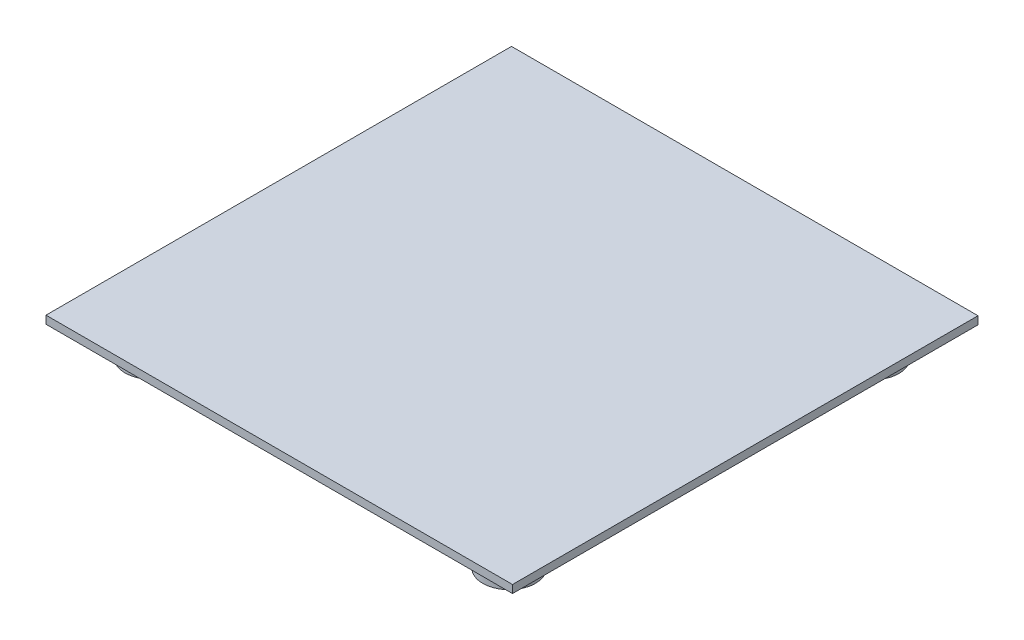
ISO-10303-21;
HEADER;
FILE_DESCRIPTION(('STEP AP214'),'2;1');
FILE_NAME('part.step','',(''),(''),'','','');
FILE_SCHEMA(('AUTOMOTIVE_DESIGN { 1 0 10303 214 1 1 1 1 }'));
ENDSEC;
DATA;
#1=APPLICATION_CONTEXT('core data for automotive mechanical design processes');
#2=APPLICATION_PROTOCOL_DEFINITION('international standard','automotive_design',2000,#1);
#3=PRODUCT_CONTEXT('',#1,'mechanical');
#4=PRODUCT('Part','Part','',(#3));
#5=PRODUCT_RELATED_PRODUCT_CATEGORY('part','',(#4));
#6=PRODUCT_DEFINITION_FORMATION('','',#4);
#7=PRODUCT_DEFINITION_CONTEXT('part definition',#1,'design');
#8=PRODUCT_DEFINITION('design','',#6,#7);
#9=PRODUCT_DEFINITION_SHAPE('','',#8);
#10=(LENGTH_UNIT() NAMED_UNIT(*) SI_UNIT(.MILLI.,.METRE.));
#11=(NAMED_UNIT(*) PLANE_ANGLE_UNIT() SI_UNIT($,.RADIAN.));
#12=(NAMED_UNIT(*) SI_UNIT($,.STERADIAN.) SOLID_ANGLE_UNIT());
#13=UNCERTAINTY_MEASURE_WITH_UNIT(LENGTH_MEASURE(1.E-05),#10,'distance_accuracy_value','');
#14=(GEOMETRIC_REPRESENTATION_CONTEXT(3) GLOBAL_UNCERTAINTY_ASSIGNED_CONTEXT((#13)) GLOBAL_UNIT_ASSIGNED_CONTEXT((#10,
#11,#12)) REPRESENTATION_CONTEXT('',''));
#15=CARTESIAN_POINT('',(0.,0.,0.));
#16=DIRECTION('',(0.,0.,1.));
#17=DIRECTION('',(1.,0.,0.));
#18=AXIS2_PLACEMENT_3D('',#15,#16,#17);
#19=CARTESIAN_POINT('',(0.,3.,0.));
#20=DIRECTION('',(1.,0.,0.));
#21=DIRECTION('',(0.,0.,-1.));
#22=AXIS2_PLACEMENT_3D('',#19,#20,#21);
#23=PLANE('',#22);
#24=DIRECTION('',(0.,0.,1.));
#25=VECTOR('',#24,1.);
#26=CARTESIAN_POINT('',(0.,0.,0.));
#27=LINE('',#26,#25);
#28=CARTESIAN_POINT('',(0.,0.,0.));
#29=VERTEX_POINT('',#28);
#30=CARTESIAN_POINT('',(0.,0.,176.52));
#31=VERTEX_POINT('',#30);
#32=EDGE_CURVE('E104',#29,#31,#27,.T.);
#33=ORIENTED_EDGE('',*,*,#32,.T.);
#34=DIRECTION('',(0.,-1.,0.));
#35=VECTOR('',#34,1.);
#36=CARTESIAN_POINT('',(0.,3.,176.52));
#37=LINE('',#36,#35);
#38=CARTESIAN_POINT('',(0.,3.,176.52));
#39=VERTEX_POINT('',#38);
#40=EDGE_CURVE('E95',#39,#31,#37,.T.);
#41=ORIENTED_EDGE('',*,*,#40,.F.);
#42=DIRECTION('',(0.,0.,1.));
#43=VECTOR('',#42,1.);
#44=CARTESIAN_POINT('',(0.,3.,0.));
#45=LINE('',#44,#43);
#46=CARTESIAN_POINT('',(0.,3.,0.));
#47=VERTEX_POINT('',#46);
#48=EDGE_CURVE('E89',#47,#39,#45,.T.);
#49=ORIENTED_EDGE('',*,*,#48,.F.);
#50=DIRECTION('',(0.,-1.,0.));
#51=VECTOR('',#50,1.);
#52=CARTESIAN_POINT('',(0.,3.,0.));
#53=LINE('',#52,#51);
#54=EDGE_CURVE('E100',#47,#29,#53,.T.);
#55=ORIENTED_EDGE('',*,*,#54,.T.);
#56=EDGE_LOOP('',(#33,#41,#49,#55));
#57=FACE_BOUND('',#56,.T.);
#58=ADVANCED_FACE('F37',(#57),#23,.F.);
#59=CARTESIAN_POINT('',(0.,3.,176.52));
#60=DIRECTION('',(0.,0.,-1.));
#61=DIRECTION('',(-1.,0.,0.));
#62=AXIS2_PLACEMENT_3D('',#59,#60,#61);
#63=PLANE('',#62);
#64=DIRECTION('',(1.,0.,0.));
#65=VECTOR('',#64,1.);
#66=CARTESIAN_POINT('',(0.,0.,176.52));
#67=LINE('',#66,#65);
#68=CARTESIAN_POINT('',(176.9,0.,176.52));
#69=VERTEX_POINT('',#68);
#70=EDGE_CURVE('E94',#31,#69,#67,.T.);
#71=ORIENTED_EDGE('',*,*,#70,.T.);
#72=DIRECTION('',(0.,-1.,0.));
#73=VECTOR('',#72,1.);
#74=CARTESIAN_POINT('',(176.9,3.,176.52));
#75=LINE('',#74,#73);
#76=CARTESIAN_POINT('',(176.9,3.,176.52));
#77=VERTEX_POINT('',#76);
#78=EDGE_CURVE('E92',#77,#69,#75,.T.);
#79=ORIENTED_EDGE('',*,*,#78,.F.);
#80=DIRECTION('',(1.,0.,0.));
#81=VECTOR('',#80,1.);
#82=CARTESIAN_POINT('',(0.,3.,176.52));
#83=LINE('',#82,#81);
#84=EDGE_CURVE('E84',#39,#77,#83,.T.);
#85=ORIENTED_EDGE('',*,*,#84,.F.);
#86=ORIENTED_EDGE('',*,*,#40,.T.);
#87=EDGE_LOOP('',(#71,#79,#85,#86));
#88=FACE_BOUND('',#87,.T.);
#89=ADVANCED_FACE('F93',(#88),#63,.F.);
#90=CARTESIAN_POINT('',(176.9,3.,0.));
#91=DIRECTION('',(-1.,0.,0.));
#92=DIRECTION('',(0.,0.,1.));
#93=AXIS2_PLACEMENT_3D('',#90,#91,#92);
#94=PLANE('',#93);
#95=DIRECTION('',(0.,0.,-1.));
#96=VECTOR('',#95,1.);
#97=CARTESIAN_POINT('',(176.9,0.,0.));
#98=LINE('',#97,#96);
#99=CARTESIAN_POINT('',(176.9,0.,0.));
#100=VERTEX_POINT('',#99);
#101=EDGE_CURVE('E70',#69,#100,#98,.T.);
#102=ORIENTED_EDGE('',*,*,#101,.T.);
#103=DIRECTION('',(0.,-1.,0.));
#104=VECTOR('',#103,1.);
#105=CARTESIAN_POINT('',(176.9,3.,0.));
#106=LINE('',#105,#104);
#107=CARTESIAN_POINT('',(176.9,3.,0.));
#108=VERTEX_POINT('',#107);
#109=EDGE_CURVE('E96',#108,#100,#106,.T.);
#110=ORIENTED_EDGE('',*,*,#109,.F.);
#111=DIRECTION('',(0.,0.,-1.));
#112=VECTOR('',#111,1.);
#113=CARTESIAN_POINT('',(176.9,3.,0.));
#114=LINE('',#113,#112);
#115=EDGE_CURVE('E87',#77,#108,#114,.T.);
#116=ORIENTED_EDGE('',*,*,#115,.F.);
#117=ORIENTED_EDGE('',*,*,#78,.T.);
#118=EDGE_LOOP('',(#102,#110,#116,#117));
#119=FACE_BOUND('',#118,.T.);
#120=ADVANCED_FACE('F98',(#119),#94,.F.);
#121=CARTESIAN_POINT('',(0.,3.,0.));
#122=DIRECTION('',(0.,0.,1.));
#123=DIRECTION('',(1.,0.,0.));
#124=AXIS2_PLACEMENT_3D('',#121,#122,#123);
#125=PLANE('',#124);
#126=DIRECTION('',(-1.,0.,0.));
#127=VECTOR('',#126,1.);
#128=CARTESIAN_POINT('',(0.,0.,0.));
#129=LINE('',#128,#127);
#130=EDGE_CURVE('E76',#100,#29,#129,.T.);
#131=ORIENTED_EDGE('',*,*,#130,.T.);
#132=ORIENTED_EDGE('',*,*,#54,.F.);
#133=DIRECTION('',(-1.,0.,0.));
#134=VECTOR('',#133,1.);
#135=CARTESIAN_POINT('',(0.,3.,0.));
#136=LINE('',#135,#134);
#137=EDGE_CURVE('E53',#108,#47,#136,.T.);
#138=ORIENTED_EDGE('',*,*,#137,.F.);
#139=ORIENTED_EDGE('',*,*,#109,.T.);
#140=EDGE_LOOP('',(#131,#132,#138,#139));
#141=FACE_BOUND('',#140,.T.);
#142=ADVANCED_FACE('F136',(#141),#125,.F.);
#143=CARTESIAN_POINT('',(0.,3.,0.));
#144=DIRECTION('',(0.,1.,0.));
#145=DIRECTION('',(0.,0.,1.));
#146=AXIS2_PLACEMENT_3D('',#143,#144,#145);
#147=PLANE('',#146);
#148=ORIENTED_EDGE('',*,*,#48,.T.);
#149=ORIENTED_EDGE('',*,*,#84,.T.);
#150=ORIENTED_EDGE('',*,*,#115,.T.);
#151=ORIENTED_EDGE('',*,*,#137,.T.);
#152=EDGE_LOOP('',(#148,#149,#150,#151));
#153=FACE_BOUND('',#152,.T.);
#154=ADVANCED_FACE('F85',(#153),#147,.T.);
#155=CARTESIAN_POINT('',(0.,0.,0.));
#156=DIRECTION('',(0.,1.,0.));
#157=DIRECTION('',(0.,0.,1.));
#158=AXIS2_PLACEMENT_3D('',#155,#156,#157);
#159=PLANE('',#158);
#160=CARTESIAN_POINT('',(156.9,0.,157.806439707891));
#161=DIRECTION('',(0.,1.,0.));
#162=DIRECTION('',(0.,0.,1.));
#163=AXIS2_PLACEMENT_3D('',#160,#161,#162);
#164=CIRCLE('',#163,10.);
#165=CARTESIAN_POINT('',(156.9,0.,167.806439707891));
#166=VERTEX_POINT('',#165);
#167=EDGE_CURVE('E11',#166,#166,#164,.F.);
#168=ORIENTED_EDGE('',*,*,#167,.F.);
#169=EDGE_LOOP('',(#168));
#170=FACE_BOUND('',#169,.T.);
#171=CARTESIAN_POINT('',(20.,0.,20.));
#172=DIRECTION('',(0.,1.,0.));
#173=DIRECTION('',(0.,0.,1.));
#174=AXIS2_PLACEMENT_3D('',#171,#172,#173);
#175=CIRCLE('',#174,10.);
#176=CARTESIAN_POINT('',(20.,0.,30.));
#177=VERTEX_POINT('',#176);
#178=EDGE_CURVE('E45',#177,#177,#175,.F.);
#179=ORIENTED_EDGE('',*,*,#178,.F.);
#180=EDGE_LOOP('',(#179));
#181=FACE_BOUND('',#180,.T.);
#182=CARTESIAN_POINT('',(156.9,0.,20.));
#183=DIRECTION('',(0.,1.,0.));
#184=DIRECTION('',(0.,0.,1.));
#185=AXIS2_PLACEMENT_3D('',#182,#183,#184);
#186=CIRCLE('',#185,10.);
#187=CARTESIAN_POINT('',(156.9,0.,30.));
#188=VERTEX_POINT('',#187);
#189=EDGE_CURVE('E117',#188,#188,#186,.F.);
#190=ORIENTED_EDGE('',*,*,#189,.F.);
#191=EDGE_LOOP('',(#190));
#192=FACE_BOUND('',#191,.T.);
#193=CARTESIAN_POINT('',(20.,0.,156.52));
#194=DIRECTION('',(0.,1.,0.));
#195=DIRECTION('',(0.,0.,1.));
#196=AXIS2_PLACEMENT_3D('',#193,#194,#195);
#197=CIRCLE('',#196,10.);
#198=CARTESIAN_POINT('',(20.,0.,166.52));
#199=VERTEX_POINT('',#198);
#200=EDGE_CURVE('E114',#199,#199,#197,.F.);
#201=ORIENTED_EDGE('',*,*,#200,.F.);
#202=EDGE_LOOP('',(#201));
#203=FACE_BOUND('',#202,.T.);
#204=ORIENTED_EDGE('',*,*,#32,.F.);
#205=ORIENTED_EDGE('',*,*,#130,.F.);
#206=ORIENTED_EDGE('',*,*,#101,.F.);
#207=ORIENTED_EDGE('',*,*,#70,.F.);
#208=EDGE_LOOP('',(#204,#205,#206,#207));
#209=FACE_BOUND('',#208,.T.);
#210=ADVANCED_FACE('F124',(#170,#181,#192,#203,#209),#159,.F.);
#211=CARTESIAN_POINT('',(20.,-11.,156.52));
#212=DIRECTION('',(0.,1.,0.));
#213=DIRECTION('',(0.,0.,1.));
#214=AXIS2_PLACEMENT_3D('',#211,#212,#213);
#215=CYLINDRICAL_SURFACE('',#214,10.);
#216=CARTESIAN_POINT('',(20.,-11.,156.52));
#217=DIRECTION('',(0.,-1.,0.));
#218=DIRECTION('',(0.,0.,-1.));
#219=AXIS2_PLACEMENT_3D('',#216,#217,#218);
#220=CIRCLE('',#219,10.);
#221=CARTESIAN_POINT('',(20.,-11.,146.52));
#222=VERTEX_POINT('',#221);
#223=EDGE_CURVE('E107',#222,#222,#220,.T.);
#224=ORIENTED_EDGE('',*,*,#223,.F.);
#225=EDGE_LOOP('',(#224));
#226=FACE_BOUND('',#225,.T.);
#227=ORIENTED_EDGE('',*,*,#200,.T.);
#228=EDGE_LOOP('',(#227));
#229=FACE_BOUND('',#228,.T.);
#230=ADVANCED_FACE('F127',(#226,#229),#215,.T.);
#231=CARTESIAN_POINT('',(20.,-11.,156.52));
#232=DIRECTION('',(0.,-1.,0.));
#233=DIRECTION('',(0.,0.,-1.));
#234=AXIS2_PLACEMENT_3D('',#231,#232,#233);
#235=PLANE('',#234);
#236=ORIENTED_EDGE('',*,*,#223,.T.);
#237=EDGE_LOOP('',(#236));
#238=FACE_BOUND('',#237,.T.);
#239=ADVANCED_FACE('F180',(#238),#235,.T.);
#240=CARTESIAN_POINT('',(156.9,-11.,20.));
#241=DIRECTION('',(0.,1.,0.));
#242=DIRECTION('',(0.,0.,1.));
#243=AXIS2_PLACEMENT_3D('',#240,#241,#242);
#244=CYLINDRICAL_SURFACE('',#243,10.);
#245=CARTESIAN_POINT('',(156.9,-11.,20.));
#246=DIRECTION('',(0.,-1.,0.));
#247=DIRECTION('',(0.,0.,-1.));
#248=AXIS2_PLACEMENT_3D('',#245,#246,#247);
#249=CIRCLE('',#248,10.);
#250=CARTESIAN_POINT('',(156.9,-11.,9.99999999999999));
#251=VERTEX_POINT('',#250);
#252=EDGE_CURVE('E259',#251,#251,#249,.T.);
#253=ORIENTED_EDGE('',*,*,#252,.F.);
#254=EDGE_LOOP('',(#253));
#255=FACE_BOUND('',#254,.T.);
#256=ORIENTED_EDGE('',*,*,#189,.T.);
#257=EDGE_LOOP('',(#256));
#258=FACE_BOUND('',#257,.T.);
#259=ADVANCED_FACE('F190',(#255,#258),#244,.T.);
#260=CARTESIAN_POINT('',(156.9,-11.,20.));
#261=DIRECTION('',(0.,-1.,0.));
#262=DIRECTION('',(0.,0.,-1.));
#263=AXIS2_PLACEMENT_3D('',#260,#261,#262);
#264=PLANE('',#263);
#265=ORIENTED_EDGE('',*,*,#252,.T.);
#266=EDGE_LOOP('',(#265));
#267=FACE_BOUND('',#266,.T.);
#268=ADVANCED_FACE('F200',(#267),#264,.T.);
#269=CARTESIAN_POINT('',(20.,-11.,20.));
#270=DIRECTION('',(0.,1.,0.));
#271=DIRECTION('',(0.,0.,1.));
#272=AXIS2_PLACEMENT_3D('',#269,#270,#271);
#273=CYLINDRICAL_SURFACE('',#272,10.);
#274=CARTESIAN_POINT('',(20.,-11.,20.));
#275=DIRECTION('',(0.,-1.,0.));
#276=DIRECTION('',(0.,0.,-1.));
#277=AXIS2_PLACEMENT_3D('',#274,#275,#276);
#278=CIRCLE('',#277,10.);
#279=CARTESIAN_POINT('',(20.,-11.,10.));
#280=VERTEX_POINT('',#279);
#281=EDGE_CURVE('E256',#280,#280,#278,.T.);
#282=ORIENTED_EDGE('',*,*,#281,.F.);
#283=EDGE_LOOP('',(#282));
#284=FACE_BOUND('',#283,.T.);
#285=ORIENTED_EDGE('',*,*,#178,.T.);
#286=EDGE_LOOP('',(#285));
#287=FACE_BOUND('',#286,.T.);
#288=ADVANCED_FACE('F122',(#284,#287),#273,.T.);
#289=CARTESIAN_POINT('',(20.,-11.,20.));
#290=DIRECTION('',(0.,-1.,0.));
#291=DIRECTION('',(0.,0.,-1.));
#292=AXIS2_PLACEMENT_3D('',#289,#290,#291);
#293=PLANE('',#292);
#294=ORIENTED_EDGE('',*,*,#281,.T.);
#295=EDGE_LOOP('',(#294));
#296=FACE_BOUND('',#295,.T.);
#297=ADVANCED_FACE('F219',(#296),#293,.T.);
#298=CARTESIAN_POINT('',(156.9,-11.,157.806439707891));
#299=DIRECTION('',(0.,1.,0.));
#300=DIRECTION('',(0.,0.,1.));
#301=AXIS2_PLACEMENT_3D('',#298,#299,#300);
#302=CYLINDRICAL_SURFACE('',#301,10.);
#303=CARTESIAN_POINT('',(156.9,-11.,157.806439707891));
#304=DIRECTION('',(0.,-1.,0.));
#305=DIRECTION('',(0.,0.,-1.));
#306=AXIS2_PLACEMENT_3D('',#303,#304,#305);
#307=CIRCLE('',#306,10.);
#308=CARTESIAN_POINT('',(156.9,-11.,147.806439707891));
#309=VERTEX_POINT('',#308);
#310=EDGE_CURVE('E255',#309,#309,#307,.T.);
#311=ORIENTED_EDGE('',*,*,#310,.F.);
#312=EDGE_LOOP('',(#311));
#313=FACE_BOUND('',#312,.T.);
#314=ORIENTED_EDGE('',*,*,#167,.T.);
#315=EDGE_LOOP('',(#314));
#316=FACE_BOUND('',#315,.T.);
#317=ADVANCED_FACE('F229',(#313,#316),#302,.T.);
#318=CARTESIAN_POINT('',(156.9,-11.,157.806439707891));
#319=DIRECTION('',(0.,-1.,0.));
#320=DIRECTION('',(0.,0.,-1.));
#321=AXIS2_PLACEMENT_3D('',#318,#319,#320);
#322=PLANE('',#321);
#323=ORIENTED_EDGE('',*,*,#310,.T.);
#324=EDGE_LOOP('',(#323));
#325=FACE_BOUND('',#324,.T.);
#326=ADVANCED_FACE('F239',(#325),#322,.T.);
#327=CLOSED_SHELL('',(#58,#89,#120,#142,#154,#210,#230,#239,#259,#268,#288,#297,#317,#326));
#328=MANIFOLD_SOLID_BREP('B2',#327);
#329=ADVANCED_BREP_SHAPE_REPRESENTATION('',(#18,#328),#14);
#330=SHAPE_DEFINITION_REPRESENTATION(#9,#329);
ENDSEC;
END-ISO-10303-21;
